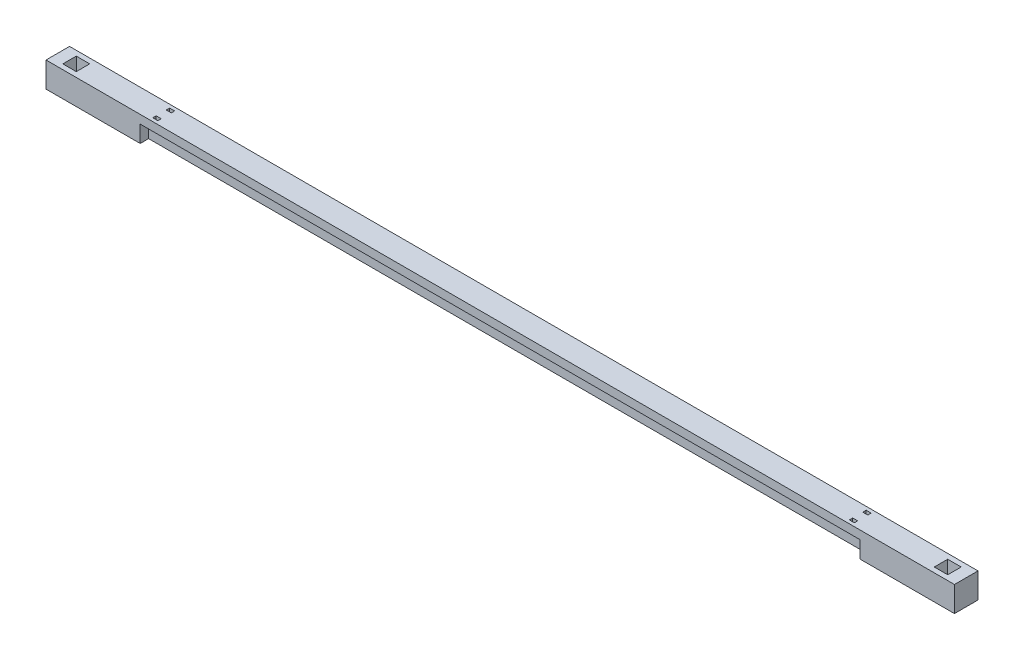
ISO-10303-21;
HEADER;
FILE_DESCRIPTION(('STEP AP214'),'2;1');
FILE_NAME('part.step','',(''),(''),'','','');
FILE_SCHEMA(('AUTOMOTIVE_DESIGN { 1 0 10303 214 1 1 1 1 }'));
ENDSEC;
DATA;
#1=APPLICATION_CONTEXT('core data for automotive mechanical design processes');
#2=APPLICATION_PROTOCOL_DEFINITION('international standard','automotive_design',2000,#1);
#3=PRODUCT_CONTEXT('',#1,'mechanical');
#4=PRODUCT('Part','Part','',(#3));
#5=PRODUCT_RELATED_PRODUCT_CATEGORY('part','',(#4));
#6=PRODUCT_DEFINITION_FORMATION('','',#4);
#7=PRODUCT_DEFINITION_CONTEXT('part definition',#1,'design');
#8=PRODUCT_DEFINITION('design','',#6,#7);
#9=PRODUCT_DEFINITION_SHAPE('','',#8);
#10=(LENGTH_UNIT() NAMED_UNIT(*) SI_UNIT(.MILLI.,.METRE.));
#11=(NAMED_UNIT(*) PLANE_ANGLE_UNIT() SI_UNIT($,.RADIAN.));
#12=(NAMED_UNIT(*) SI_UNIT($,.STERADIAN.) SOLID_ANGLE_UNIT());
#13=UNCERTAINTY_MEASURE_WITH_UNIT(LENGTH_MEASURE(1.E-05),#10,'distance_accuracy_value','');
#14=(GEOMETRIC_REPRESENTATION_CONTEXT(3) GLOBAL_UNCERTAINTY_ASSIGNED_CONTEXT((#13)) GLOBAL_UNIT_ASSIGNED_CONTEXT((#10,
#11,#12)) REPRESENTATION_CONTEXT('',''));
#15=CARTESIAN_POINT('',(0.,0.,0.));
#16=DIRECTION('',(0.,0.,1.));
#17=DIRECTION('',(1.,0.,0.));
#18=AXIS2_PLACEMENT_3D('',#15,#16,#17);
#19=CARTESIAN_POINT('',(0.,150.,0.));
#20=DIRECTION('',(0.,-1.,0.));
#21=DIRECTION('',(0.,0.,-1.));
#22=AXIS2_PLACEMENT_3D('',#19,#20,#21);
#23=PLANE('',#22);
#24=DIRECTION('',(0.,0.,1.));
#25=VECTOR('',#24,1.);
#26=CARTESIAN_POINT('',(0.,150.,50.));
#27=LINE('',#26,#25);
#28=CARTESIAN_POINT('',(0.,150.,-90.));
#29=VERTEX_POINT('',#28);
#30=CARTESIAN_POINT('',(0.,150.,50.));
#31=VERTEX_POINT('',#30);
#32=EDGE_CURVE('E511',#29,#31,#27,.T.);
#33=ORIENTED_EDGE('',*,*,#32,.T.);
#34=DIRECTION('',(1.,0.,0.));
#35=VECTOR('',#34,1.);
#36=CARTESIAN_POINT('',(0.,150.,50.));
#37=LINE('',#36,#35);
#38=CARTESIAN_POINT('',(5400.,150.,50.));
#39=VERTEX_POINT('',#38);
#40=EDGE_CURVE('E514',#31,#39,#37,.T.);
#41=ORIENTED_EDGE('',*,*,#40,.T.);
#42=DIRECTION('',(0.,0.,-1.));
#43=VECTOR('',#42,1.);
#44=CARTESIAN_POINT('',(5400.,150.,50.));
#45=LINE('',#44,#43);
#46=CARTESIAN_POINT('',(5400.,150.,-90.000000000002));
#47=VERTEX_POINT('',#46);
#48=EDGE_CURVE('E517',#39,#47,#45,.T.);
#49=ORIENTED_EDGE('',*,*,#48,.T.);
#50=DIRECTION('',(-1.,0.,0.));
#51=VECTOR('',#50,1.);
#52=CARTESIAN_POINT('',(0.,150.,-90.));
#53=LINE('',#52,#51);
#54=EDGE_CURVE('E519',#47,#29,#53,.T.);
#55=ORIENTED_EDGE('',*,*,#54,.T.);
#56=EDGE_LOOP('',(#33,#41,#49,#55));
#57=FACE_BOUND('',#56,.T.);
#58=DIRECTION('',(0.,0.,1.));
#59=VECTOR('',#58,1.);
#60=CARTESIAN_POINT('',(615.,150.,0.));
#61=LINE('',#60,#59);
#62=CARTESIAN_POINT('',(615.,150.,9.99999999999999));
#63=VERTEX_POINT('',#62);
#64=CARTESIAN_POINT('',(615.,150.,30.));
#65=VERTEX_POINT('',#64);
#66=EDGE_CURVE('E492',#63,#65,#61,.T.);
#67=ORIENTED_EDGE('',*,*,#66,.F.);
#68=DIRECTION('',(1.,0.,0.));
#69=VECTOR('',#68,1.);
#70=CARTESIAN_POINT('',(0.,150.,9.99999999999999));
#71=LINE('',#70,#69);
#72=CARTESIAN_POINT('',(645.,150.,9.99999999999999));
#73=VERTEX_POINT('',#72);
#74=EDGE_CURVE('E482',#63,#73,#71,.T.);
#75=ORIENTED_EDGE('',*,*,#74,.T.);
#76=DIRECTION('',(0.,0.,1.));
#77=VECTOR('',#76,1.);
#78=CARTESIAN_POINT('',(645.,150.,0.));
#79=LINE('',#78,#77);
#80=CARTESIAN_POINT('',(645.,150.,30.));
#81=VERTEX_POINT('',#80);
#82=EDGE_CURVE('E485',#73,#81,#79,.T.);
#83=ORIENTED_EDGE('',*,*,#82,.T.);
#84=DIRECTION('',(1.,0.,0.));
#85=VECTOR('',#84,1.);
#86=CARTESIAN_POINT('',(0.,150.,30.));
#87=LINE('',#86,#85);
#88=EDGE_CURVE('E489',#65,#81,#87,.T.);
#89=ORIENTED_EDGE('',*,*,#88,.F.);
#90=EDGE_LOOP('',(#67,#75,#83,#89));
#91=FACE_BOUND('',#90,.T.);
#92=DIRECTION('',(1.,0.,0.));
#93=VECTOR('',#92,1.);
#94=CARTESIAN_POINT('',(0.,150.,-70.000000000002));
#95=LINE('',#94,#93);
#96=CARTESIAN_POINT('',(615.,150.,-70.000000000002));
#97=VERTEX_POINT('',#96);
#98=CARTESIAN_POINT('',(645.,150.,-70.000000000002));
#99=VERTEX_POINT('',#98);
#100=EDGE_CURVE('E458',#97,#99,#95,.T.);
#101=ORIENTED_EDGE('',*,*,#100,.T.);
#102=DIRECTION('',(0.,0.,1.));
#103=VECTOR('',#102,1.);
#104=CARTESIAN_POINT('',(645.,150.,0.));
#105=LINE('',#104,#103);
#106=CARTESIAN_POINT('',(645.,150.,-50.000000000002));
#107=VERTEX_POINT('',#106);
#108=EDGE_CURVE('E448',#99,#107,#105,.T.);
#109=ORIENTED_EDGE('',*,*,#108,.T.);
#110=DIRECTION('',(-1.,0.,0.));
#111=VECTOR('',#110,1.);
#112=CARTESIAN_POINT('',(0.,150.,-50.0000000000021));
#113=LINE('',#112,#111);
#114=CARTESIAN_POINT('',(615.,150.,-50.000000000002));
#115=VERTEX_POINT('',#114);
#116=EDGE_CURVE('E451',#107,#115,#113,.T.);
#117=ORIENTED_EDGE('',*,*,#116,.T.);
#118=DIRECTION('',(0.,0.,-1.));
#119=VECTOR('',#118,1.);
#120=CARTESIAN_POINT('',(615.,150.,0.));
#121=LINE('',#120,#119);
#122=EDGE_CURVE('E455',#115,#97,#121,.T.);
#123=ORIENTED_EDGE('',*,*,#122,.T.);
#124=EDGE_LOOP('',(#101,#109,#117,#123));
#125=FACE_BOUND('',#124,.T.);
#126=DIRECTION('',(0.,0.,1.));
#127=VECTOR('',#126,1.);
#128=CARTESIAN_POINT('',(4755.,150.,0.));
#129=LINE('',#128,#127);
#130=CARTESIAN_POINT('',(4755.,150.,10.));
#131=VERTEX_POINT('',#130);
#132=CARTESIAN_POINT('',(4755.,150.,30.));
#133=VERTEX_POINT('',#132);
#134=EDGE_CURVE('E429',#131,#133,#129,.T.);
#135=ORIENTED_EDGE('',*,*,#134,.F.);
#136=DIRECTION('',(1.,0.,0.));
#137=VECTOR('',#136,1.);
#138=CARTESIAN_POINT('',(4140.,150.,10.));
#139=LINE('',#138,#137);
#140=CARTESIAN_POINT('',(4785.,150.,10.));
#141=VERTEX_POINT('',#140);
#142=EDGE_CURVE('E419',#131,#141,#139,.T.);
#143=ORIENTED_EDGE('',*,*,#142,.T.);
#144=DIRECTION('',(0.,0.,1.));
#145=VECTOR('',#144,1.);
#146=CARTESIAN_POINT('',(4785.,150.,0.));
#147=LINE('',#146,#145);
#148=CARTESIAN_POINT('',(4785.,150.,30.));
#149=VERTEX_POINT('',#148);
#150=EDGE_CURVE('E422',#141,#149,#147,.T.);
#151=ORIENTED_EDGE('',*,*,#150,.T.);
#152=DIRECTION('',(1.,0.,0.));
#153=VECTOR('',#152,1.);
#154=CARTESIAN_POINT('',(4140.,150.,30.));
#155=LINE('',#154,#153);
#156=EDGE_CURVE('E426',#133,#149,#155,.T.);
#157=ORIENTED_EDGE('',*,*,#156,.F.);
#158=EDGE_LOOP('',(#135,#143,#151,#157));
#159=FACE_BOUND('',#158,.T.);
#160=DIRECTION('',(1.,0.,0.));
#161=VECTOR('',#160,1.);
#162=CARTESIAN_POINT('',(4140.,150.,-70.000000000002));
#163=LINE('',#162,#161);
#164=CARTESIAN_POINT('',(4755.,150.,-70.000000000002));
#165=VERTEX_POINT('',#164);
#166=CARTESIAN_POINT('',(4785.,150.,-70.000000000002));
#167=VERTEX_POINT('',#166);
#168=EDGE_CURVE('E395',#165,#167,#163,.T.);
#169=ORIENTED_EDGE('',*,*,#168,.T.);
#170=DIRECTION('',(0.,0.,1.));
#171=VECTOR('',#170,1.);
#172=CARTESIAN_POINT('',(4785.,150.,0.));
#173=LINE('',#172,#171);
#174=CARTESIAN_POINT('',(4785.,150.,-50.000000000002));
#175=VERTEX_POINT('',#174);
#176=EDGE_CURVE('E385',#167,#175,#173,.T.);
#177=ORIENTED_EDGE('',*,*,#176,.T.);
#178=DIRECTION('',(-1.,0.,0.));
#179=VECTOR('',#178,1.);
#180=CARTESIAN_POINT('',(4140.,150.,-50.0000000000021));
#181=LINE('',#180,#179);
#182=CARTESIAN_POINT('',(4755.,150.,-50.000000000002));
#183=VERTEX_POINT('',#182);
#184=EDGE_CURVE('E388',#175,#183,#181,.T.);
#185=ORIENTED_EDGE('',*,*,#184,.T.);
#186=DIRECTION('',(0.,0.,-1.));
#187=VECTOR('',#186,1.);
#188=CARTESIAN_POINT('',(4755.,150.,0.));
#189=LINE('',#188,#187);
#190=EDGE_CURVE('E392',#183,#165,#189,.T.);
#191=ORIENTED_EDGE('',*,*,#190,.T.);
#192=EDGE_LOOP('',(#169,#177,#185,#191));
#193=FACE_BOUND('',#192,.T.);
#194=DIRECTION('',(-1.,0.,0.));
#195=VECTOR('',#194,1.);
#196=CARTESIAN_POINT('',(5330.,150.,-60.));
#197=LINE('',#196,#195);
#198=CARTESIAN_POINT('',(5330.,150.,-60.));
#199=VERTEX_POINT('',#198);
#200=CARTESIAN_POINT('',(5250.,150.,-60.));
#201=VERTEX_POINT('',#200);
#202=EDGE_CURVE('E322',#199,#201,#197,.T.);
#203=ORIENTED_EDGE('',*,*,#202,.F.);
#204=DIRECTION('',(0.,0.,-1.));
#205=VECTOR('',#204,1.);
#206=CARTESIAN_POINT('',(5330.,150.,-60.));
#207=LINE('',#206,#205);
#208=CARTESIAN_POINT('',(5330.,150.,20.));
#209=VERTEX_POINT('',#208);
#210=EDGE_CURVE('E59',#209,#199,#207,.T.);
#211=ORIENTED_EDGE('',*,*,#210,.F.);
#212=DIRECTION('',(1.,0.,0.));
#213=VECTOR('',#212,1.);
#214=CARTESIAN_POINT('',(5330.,150.,20.));
#215=LINE('',#214,#213);
#216=CARTESIAN_POINT('',(5250.,150.,20.));
#217=VERTEX_POINT('',#216);
#218=EDGE_CURVE('E311',#217,#209,#215,.T.);
#219=ORIENTED_EDGE('',*,*,#218,.F.);
#220=DIRECTION('',(0.,0.,1.));
#221=VECTOR('',#220,1.);
#222=CARTESIAN_POINT('',(5250.,150.,-60.));
#223=LINE('',#222,#221);
#224=EDGE_CURVE('E325',#201,#217,#223,.T.);
#225=ORIENTED_EDGE('',*,*,#224,.F.);
#226=EDGE_LOOP('',(#203,#211,#219,#225));
#227=FACE_BOUND('',#226,.T.);
#228=DIRECTION('',(0.,0.,-1.));
#229=VECTOR('',#228,1.);
#230=CARTESIAN_POINT('',(70.0000000000003,150.,-60.));
#231=LINE('',#230,#229);
#232=CARTESIAN_POINT('',(70.0000000000003,150.,20.));
#233=VERTEX_POINT('',#232);
#234=CARTESIAN_POINT('',(70.0000000000003,150.,-60.));
#235=VERTEX_POINT('',#234);
#236=EDGE_CURVE('E51',#233,#235,#231,.T.);
#237=ORIENTED_EDGE('',*,*,#236,.T.);
#238=DIRECTION('',(1.,0.,0.));
#239=VECTOR('',#238,1.);
#240=CARTESIAN_POINT('',(70.0000000000003,150.,-60.));
#241=LINE('',#240,#239);
#242=CARTESIAN_POINT('',(150.000000000001,150.,-60.));
#243=VERTEX_POINT('',#242);
#244=EDGE_CURVE('E289',#235,#243,#241,.T.);
#245=ORIENTED_EDGE('',*,*,#244,.T.);
#246=DIRECTION('',(0.,0.,1.));
#247=VECTOR('',#246,1.);
#248=CARTESIAN_POINT('',(150.000000000001,150.,-60.));
#249=LINE('',#248,#247);
#250=CARTESIAN_POINT('',(150.,150.,20.));
#251=VERTEX_POINT('',#250);
#252=EDGE_CURVE('E292',#243,#251,#249,.T.);
#253=ORIENTED_EDGE('',*,*,#252,.T.);
#254=DIRECTION('',(-1.,0.,0.));
#255=VECTOR('',#254,1.);
#256=CARTESIAN_POINT('',(70.0000000000003,150.,20.));
#257=LINE('',#256,#255);
#258=EDGE_CURVE('E298',#251,#233,#257,.T.);
#259=ORIENTED_EDGE('',*,*,#258,.T.);
#260=EDGE_LOOP('',(#237,#245,#253,#259));
#261=FACE_BOUND('',#260,.T.);
#262=ADVANCED_FACE('F36',(#57,#91,#125,#159,#193,#227,#261),#23,.F.);
#263=CARTESIAN_POINT('',(0.,100.,0.));
#264=DIRECTION('',(1.,0.,0.));
#265=DIRECTION('',(0.,0.,-1.));
#266=AXIS2_PLACEMENT_3D('',#263,#264,#265);
#267=PLANE('',#266);
#268=DIRECTION('',(0.,0.,1.));
#269=VECTOR('',#268,1.);
#270=CARTESIAN_POINT('',(0.,0.,0.));
#271=LINE('',#270,#269);
#272=CARTESIAN_POINT('',(0.,0.,-90.));
#273=VERTEX_POINT('',#272);
#274=CARTESIAN_POINT('',(0.,0.,50.));
#275=VERTEX_POINT('',#274);
#276=EDGE_CURVE('E536',#273,#275,#271,.T.);
#277=ORIENTED_EDGE('',*,*,#276,.T.);
#278=DIRECTION('',(0.,-1.,0.));
#279=VECTOR('',#278,1.);
#280=CARTESIAN_POINT('',(0.,150.,50.));
#281=LINE('',#280,#279);
#282=EDGE_CURVE('E533',#31,#275,#281,.T.);
#283=ORIENTED_EDGE('',*,*,#282,.F.);
#284=ORIENTED_EDGE('',*,*,#32,.F.);
#285=DIRECTION('',(0.,-1.,0.));
#286=VECTOR('',#285,1.);
#287=CARTESIAN_POINT('',(0.,150.,-90.));
#288=LINE('',#287,#286);
#289=EDGE_CURVE('E521',#29,#273,#288,.T.);
#290=ORIENTED_EDGE('',*,*,#289,.T.);
#291=EDGE_LOOP('',(#277,#283,#284,#290));
#292=FACE_BOUND('',#291,.T.);
#293=ADVANCED_FACE('F38',(#292),#267,.F.);
#294=CARTESIAN_POINT('',(0.,100.,0.));
#295=DIRECTION('',(0.,0.,-1.));
#296=DIRECTION('',(-1.,0.,0.));
#297=AXIS2_PLACEMENT_3D('',#294,#295,#296);
#298=PLANE('',#297);
#299=DIRECTION('',(1.,0.,0.));
#300=VECTOR('',#299,1.);
#301=CARTESIAN_POINT('',(0.,100.,0.));
#302=LINE('',#301,#300);
#303=CARTESIAN_POINT('',(560.,100.,0.));
#304=VERTEX_POINT('',#303);
#305=CARTESIAN_POINT('',(4840.,100.,0.));
#306=VERTEX_POINT('',#305);
#307=EDGE_CURVE('E537',#304,#306,#302,.T.);
#308=ORIENTED_EDGE('',*,*,#307,.F.);
#309=DIRECTION('',(0.,-1.,0.));
#310=VECTOR('',#309,1.);
#311=CARTESIAN_POINT('',(560.,100.,0.));
#312=LINE('',#311,#310);
#313=CARTESIAN_POINT('',(560.,0.,0.));
#314=VERTEX_POINT('',#313);
#315=EDGE_CURVE('E358',#304,#314,#312,.T.);
#316=ORIENTED_EDGE('',*,*,#315,.T.);
#317=DIRECTION('',(1.,0.,0.));
#318=VECTOR('',#317,1.);
#319=CARTESIAN_POINT('',(0.,0.,0.));
#320=LINE('',#319,#318);
#321=CARTESIAN_POINT('',(4840.,0.,0.));
#322=VERTEX_POINT('',#321);
#323=EDGE_CURVE('E543',#314,#322,#320,.T.);
#324=ORIENTED_EDGE('',*,*,#323,.T.);
#325=DIRECTION('',(0.,1.,0.));
#326=VECTOR('',#325,1.);
#327=CARTESIAN_POINT('',(4840.,100.,0.));
#328=LINE('',#327,#326);
#329=EDGE_CURVE('E381',#322,#306,#328,.T.);
#330=ORIENTED_EDGE('',*,*,#329,.T.);
#331=EDGE_LOOP('',(#308,#316,#324,#330));
#332=FACE_BOUND('',#331,.T.);
#333=ADVANCED_FACE('F581',(#332),#298,.F.);
#334=CARTESIAN_POINT('',(5400.,100.,0.));
#335=DIRECTION('',(-1.,0.,0.));
#336=DIRECTION('',(0.,0.,1.));
#337=AXIS2_PLACEMENT_3D('',#334,#335,#336);
#338=PLANE('',#337);
#339=DIRECTION('',(0.,-1.,0.));
#340=VECTOR('',#339,1.);
#341=CARTESIAN_POINT('',(5400.,150.,50.));
#342=LINE('',#341,#340);
#343=CARTESIAN_POINT('',(5400.,0.,49.999999999998));
#344=VERTEX_POINT('',#343);
#345=EDGE_CURVE('E530',#39,#344,#342,.T.);
#346=ORIENTED_EDGE('',*,*,#345,.T.);
#347=DIRECTION('',(0.,0.,-1.));
#348=VECTOR('',#347,1.);
#349=CARTESIAN_POINT('',(5400.,0.,0.));
#350=LINE('',#349,#348);
#351=CARTESIAN_POINT('',(5400.,0.,-90.000000000002));
#352=VERTEX_POINT('',#351);
#353=EDGE_CURVE('E545',#344,#352,#350,.T.);
#354=ORIENTED_EDGE('',*,*,#353,.T.);
#355=DIRECTION('',(0.,-1.,0.));
#356=VECTOR('',#355,1.);
#357=CARTESIAN_POINT('',(5400.,150.,-90.000000000002));
#358=LINE('',#357,#356);
#359=EDGE_CURVE('E527',#47,#352,#358,.T.);
#360=ORIENTED_EDGE('',*,*,#359,.F.);
#361=ORIENTED_EDGE('',*,*,#48,.F.);
#362=EDGE_LOOP('',(#346,#354,#360,#361));
#363=FACE_BOUND('',#362,.T.);
#364=ADVANCED_FACE('F569',(#363),#338,.F.);
#365=CARTESIAN_POINT('',(0.,100.,-40.));
#366=DIRECTION('',(0.,0.,1.));
#367=DIRECTION('',(1.,0.,0.));
#368=AXIS2_PLACEMENT_3D('',#365,#366,#367);
#369=PLANE('',#368);
#370=DIRECTION('',(-1.,0.,0.));
#371=VECTOR('',#370,1.);
#372=CARTESIAN_POINT('',(0.,0.,-40.));
#373=LINE('',#372,#371);
#374=CARTESIAN_POINT('',(4840.,0.,-40.));
#375=VERTEX_POINT('',#374);
#376=CARTESIAN_POINT('',(560.,0.,-40.));
#377=VERTEX_POINT('',#376);
#378=EDGE_CURVE('E539',#375,#377,#373,.T.);
#379=ORIENTED_EDGE('',*,*,#378,.T.);
#380=DIRECTION('',(0.,1.,0.));
#381=VECTOR('',#380,1.);
#382=CARTESIAN_POINT('',(560.,100.,-40.));
#383=LINE('',#382,#381);
#384=CARTESIAN_POINT('',(560.,100.,-40.));
#385=VERTEX_POINT('',#384);
#386=EDGE_CURVE('E353',#377,#385,#383,.T.);
#387=ORIENTED_EDGE('',*,*,#386,.T.);
#388=DIRECTION('',(-1.,0.,0.));
#389=VECTOR('',#388,1.);
#390=CARTESIAN_POINT('',(0.,100.,-40.));
#391=LINE('',#390,#389);
#392=CARTESIAN_POINT('',(4840.,100.,-40.));
#393=VERTEX_POINT('',#392);
#394=EDGE_CURVE('E44',#393,#385,#391,.T.);
#395=ORIENTED_EDGE('',*,*,#394,.F.);
#396=DIRECTION('',(0.,-1.,0.));
#397=VECTOR('',#396,1.);
#398=CARTESIAN_POINT('',(4840.,100.,-40.));
#399=LINE('',#398,#397);
#400=EDGE_CURVE('E378',#393,#375,#399,.T.);
#401=ORIENTED_EDGE('',*,*,#400,.T.);
#402=EDGE_LOOP('',(#379,#387,#395,#401));
#403=FACE_BOUND('',#402,.T.);
#404=ADVANCED_FACE('F549',(#403),#369,.F.);
#405=CARTESIAN_POINT('',(0.,0.,0.));
#406=DIRECTION('',(0.,-1.,0.));
#407=DIRECTION('',(0.,0.,-1.));
#408=AXIS2_PLACEMENT_3D('',#405,#406,#407);
#409=PLANE('',#408);
#410=ORIENTED_EDGE('',*,*,#323,.F.);
#411=DIRECTION('',(0.,0.,1.));
#412=VECTOR('',#411,1.);
#413=CARTESIAN_POINT('',(560.,0.,-89.9999999999999));
#414=LINE('',#413,#412);
#415=CARTESIAN_POINT('',(560.,0.,50.0000000000001));
#416=VERTEX_POINT('',#415);
#417=EDGE_CURVE('E332',#314,#416,#414,.T.);
#418=ORIENTED_EDGE('',*,*,#417,.T.);
#419=DIRECTION('',(-1.,0.,0.));
#420=VECTOR('',#419,1.);
#421=CARTESIAN_POINT('',(560.,0.,50.0000000000001));
#422=LINE('',#421,#420);
#423=EDGE_CURVE('E345',#416,#275,#422,.T.);
#424=ORIENTED_EDGE('',*,*,#423,.T.);
#425=ORIENTED_EDGE('',*,*,#276,.F.);
#426=DIRECTION('',(1.,0.,0.));
#427=VECTOR('',#426,1.);
#428=CARTESIAN_POINT('',(560.,0.,-89.9999999999999));
#429=LINE('',#428,#427);
#430=CARTESIAN_POINT('',(560.,0.,-89.9999999999999));
#431=VERTEX_POINT('',#430);
#432=EDGE_CURVE('E348',#273,#431,#429,.T.);
#433=ORIENTED_EDGE('',*,*,#432,.T.);
#434=EDGE_CURVE('E342',#431,#377,#414,.T.);
#435=ORIENTED_EDGE('',*,*,#434,.T.);
#436=ORIENTED_EDGE('',*,*,#378,.F.);
#437=DIRECTION('',(0.,0.,-1.));
#438=VECTOR('',#437,1.);
#439=CARTESIAN_POINT('',(4840.,0.,-90.0000000000021));
#440=LINE('',#439,#438);
#441=CARTESIAN_POINT('',(4840.,0.,-90.0000000000021));
#442=VERTEX_POINT('',#441);
#443=EDGE_CURVE('E369',#375,#442,#440,.T.);
#444=ORIENTED_EDGE('',*,*,#443,.T.);
#445=DIRECTION('',(1.,0.,0.));
#446=VECTOR('',#445,1.);
#447=CARTESIAN_POINT('',(5400.,0.,-90.000000000002));
#448=LINE('',#447,#446);
#449=EDGE_CURVE('E366',#442,#352,#448,.T.);
#450=ORIENTED_EDGE('',*,*,#449,.T.);
#451=ORIENTED_EDGE('',*,*,#353,.F.);
#452=DIRECTION('',(-1.,0.,0.));
#453=VECTOR('',#452,1.);
#454=CARTESIAN_POINT('',(5400.,0.,49.999999999998));
#455=LINE('',#454,#453);
#456=CARTESIAN_POINT('',(4840.,0.,49.9999999999979));
#457=VERTEX_POINT('',#456);
#458=EDGE_CURVE('E361',#344,#457,#455,.T.);
#459=ORIENTED_EDGE('',*,*,#458,.T.);
#460=EDGE_CURVE('E370',#457,#322,#440,.T.);
#461=ORIENTED_EDGE('',*,*,#460,.T.);
#462=EDGE_LOOP('',(#410,#418,#424,#425,#433,#435,#436,#444,#450,#451,#459,#461));
#463=FACE_BOUND('',#462,.T.);
#464=ADVANCED_FACE('F555',(#463),#409,.T.);
#465=CARTESIAN_POINT('',(0.,100.,0.));
#466=DIRECTION('',(0.,-1.,0.));
#467=DIRECTION('',(0.,0.,-1.));
#468=AXIS2_PLACEMENT_3D('',#465,#466,#467);
#469=PLANE('',#468);
#470=DIRECTION('',(0.,0.,1.));
#471=VECTOR('',#470,1.);
#472=CARTESIAN_POINT('',(560.,100.,-89.9999999999999));
#473=LINE('',#472,#471);
#474=CARTESIAN_POINT('',(560.,100.,50.));
#475=VERTEX_POINT('',#474);
#476=EDGE_CURVE('E341',#304,#475,#473,.T.);
#477=ORIENTED_EDGE('',*,*,#476,.F.);
#478=ORIENTED_EDGE('',*,*,#307,.T.);
#479=DIRECTION('',(0.,0.,-1.));
#480=VECTOR('',#479,1.);
#481=CARTESIAN_POINT('',(4840.,100.,-90.0000000000021));
#482=LINE('',#481,#480);
#483=CARTESIAN_POINT('',(4840.,100.,49.9999999999979));
#484=VERTEX_POINT('',#483);
#485=EDGE_CURVE('E362',#484,#306,#482,.T.);
#486=ORIENTED_EDGE('',*,*,#485,.F.);
#487=DIRECTION('',(1.,0.,0.));
#488=VECTOR('',#487,1.);
#489=CARTESIAN_POINT('',(0.,100.,50.));
#490=LINE('',#489,#488);
#491=EDGE_CURVE('E475',#475,#484,#490,.T.);
#492=ORIENTED_EDGE('',*,*,#491,.F.);
#493=EDGE_LOOP('',(#477,#478,#486,#492));
#494=FACE_BOUND('',#493,.T.);
#495=DIRECTION('',(1.,0.,0.));
#496=VECTOR('',#495,1.);
#497=CARTESIAN_POINT('',(4140.,100.,10.));
#498=LINE('',#497,#496);
#499=CARTESIAN_POINT('',(4755.,100.,10.));
#500=VERTEX_POINT('',#499);
#501=CARTESIAN_POINT('',(4785.,100.,10.));
#502=VERTEX_POINT('',#501);
#503=EDGE_CURVE('E384',#500,#502,#498,.T.);
#504=ORIENTED_EDGE('',*,*,#503,.F.);
#505=DIRECTION('',(0.,0.,1.));
#506=VECTOR('',#505,1.);
#507=CARTESIAN_POINT('',(4755.,100.,0.));
#508=LINE('',#507,#506);
#509=CARTESIAN_POINT('',(4755.,100.,30.));
#510=VERTEX_POINT('',#509);
#511=EDGE_CURVE('E423',#500,#510,#508,.T.);
#512=ORIENTED_EDGE('',*,*,#511,.T.);
#513=DIRECTION('',(1.,0.,0.));
#514=VECTOR('',#513,1.);
#515=CARTESIAN_POINT('',(4140.,100.,30.));
#516=LINE('',#515,#514);
#517=CARTESIAN_POINT('',(4785.,100.,30.));
#518=VERTEX_POINT('',#517);
#519=EDGE_CURVE('E436',#510,#518,#516,.T.);
#520=ORIENTED_EDGE('',*,*,#519,.T.);
#521=DIRECTION('',(0.,0.,1.));
#522=VECTOR('',#521,1.);
#523=CARTESIAN_POINT('',(4785.,100.,0.));
#524=LINE('',#523,#522);
#525=EDGE_CURVE('E433',#502,#518,#524,.T.);
#526=ORIENTED_EDGE('',*,*,#525,.F.);
#527=EDGE_LOOP('',(#504,#512,#520,#526));
#528=FACE_BOUND('',#527,.T.);
#529=DIRECTION('',(1.,0.,0.));
#530=VECTOR('',#529,1.);
#531=CARTESIAN_POINT('',(0.,100.,9.99999999999999));
#532=LINE('',#531,#530);
#533=CARTESIAN_POINT('',(615.,100.,9.99999999999999));
#534=VERTEX_POINT('',#533);
#535=CARTESIAN_POINT('',(645.,100.,9.99999999999999));
#536=VERTEX_POINT('',#535);
#537=EDGE_CURVE('E412',#534,#536,#532,.T.);
#538=ORIENTED_EDGE('',*,*,#537,.F.);
#539=DIRECTION('',(0.,0.,1.));
#540=VECTOR('',#539,1.);
#541=CARTESIAN_POINT('',(615.,100.,0.));
#542=LINE('',#541,#540);
#543=CARTESIAN_POINT('',(615.,100.,30.));
#544=VERTEX_POINT('',#543);
#545=EDGE_CURVE('E486',#534,#544,#542,.T.);
#546=ORIENTED_EDGE('',*,*,#545,.T.);
#547=DIRECTION('',(1.,0.,0.));
#548=VECTOR('',#547,1.);
#549=CARTESIAN_POINT('',(0.,100.,30.));
#550=LINE('',#549,#548);
#551=CARTESIAN_POINT('',(645.,100.,30.));
#552=VERTEX_POINT('',#551);
#553=EDGE_CURVE('E499',#544,#552,#550,.T.);
#554=ORIENTED_EDGE('',*,*,#553,.T.);
#555=DIRECTION('',(0.,0.,1.));
#556=VECTOR('',#555,1.);
#557=CARTESIAN_POINT('',(645.,100.,0.));
#558=LINE('',#557,#556);
#559=EDGE_CURVE('E496',#536,#552,#558,.T.);
#560=ORIENTED_EDGE('',*,*,#559,.F.);
#561=EDGE_LOOP('',(#538,#546,#554,#560));
#562=FACE_BOUND('',#561,.T.);
#563=ADVANCED_FACE('F587',(#494,#528,#562),#469,.T.);
#564=CARTESIAN_POINT('',(0.,150.,50.));
#565=DIRECTION('',(0.,0.,-1.));
#566=DIRECTION('',(-1.,0.,0.));
#567=AXIS2_PLACEMENT_3D('',#564,#565,#566);
#568=PLANE('',#567);
#569=ORIENTED_EDGE('',*,*,#282,.T.);
#570=ORIENTED_EDGE('',*,*,#423,.F.);
#571=DIRECTION('',(0.,-1.,0.));
#572=VECTOR('',#571,1.);
#573=CARTESIAN_POINT('',(560.,100.,50.0000000000001));
#574=LINE('',#573,#572);
#575=EDGE_CURVE('E340',#475,#416,#574,.T.);
#576=ORIENTED_EDGE('',*,*,#575,.F.);
#577=ORIENTED_EDGE('',*,*,#491,.T.);
#578=DIRECTION('',(0.,-1.,0.));
#579=VECTOR('',#578,1.);
#580=CARTESIAN_POINT('',(4840.,100.,49.9999999999979));
#581=LINE('',#580,#579);
#582=EDGE_CURVE('E365',#484,#457,#581,.T.);
#583=ORIENTED_EDGE('',*,*,#582,.T.);
#584=ORIENTED_EDGE('',*,*,#458,.F.);
#585=ORIENTED_EDGE('',*,*,#345,.F.);
#586=ORIENTED_EDGE('',*,*,#40,.F.);
#587=EDGE_LOOP('',(#569,#570,#576,#577,#583,#584,#585,#586));
#588=FACE_BOUND('',#587,.T.);
#589=ADVANCED_FACE('F571',(#588),#568,.F.);
#590=CARTESIAN_POINT('',(0.,150.,-90.));
#591=DIRECTION('',(0.,0.,1.));
#592=DIRECTION('',(1.,0.,0.));
#593=AXIS2_PLACEMENT_3D('',#590,#591,#592);
#594=PLANE('',#593);
#595=ORIENTED_EDGE('',*,*,#359,.T.);
#596=ORIENTED_EDGE('',*,*,#449,.F.);
#597=DIRECTION('',(0.,-1.,0.));
#598=VECTOR('',#597,1.);
#599=CARTESIAN_POINT('',(4840.,100.,-90.0000000000021));
#600=LINE('',#599,#598);
#601=CARTESIAN_POINT('',(4840.,100.,-90.0000000000021));
#602=VERTEX_POINT('',#601);
#603=EDGE_CURVE('E375',#602,#442,#600,.T.);
#604=ORIENTED_EDGE('',*,*,#603,.F.);
#605=DIRECTION('',(-1.,0.,0.));
#606=VECTOR('',#605,1.);
#607=CARTESIAN_POINT('',(0.,100.,-90.));
#608=LINE('',#607,#606);
#609=CARTESIAN_POINT('',(560.,100.,-89.9999999999999));
#610=VERTEX_POINT('',#609);
#611=EDGE_CURVE('E515',#602,#610,#608,.T.);
#612=ORIENTED_EDGE('',*,*,#611,.T.);
#613=DIRECTION('',(0.,-1.,0.));
#614=VECTOR('',#613,1.);
#615=CARTESIAN_POINT('',(560.,100.,-89.9999999999999));
#616=LINE('',#615,#614);
#617=EDGE_CURVE('E351',#610,#431,#616,.T.);
#618=ORIENTED_EDGE('',*,*,#617,.T.);
#619=ORIENTED_EDGE('',*,*,#432,.F.);
#620=ORIENTED_EDGE('',*,*,#289,.F.);
#621=ORIENTED_EDGE('',*,*,#54,.F.);
#622=EDGE_LOOP('',(#595,#596,#604,#612,#618,#619,#620,#621));
#623=FACE_BOUND('',#622,.T.);
#624=ADVANCED_FACE('F562',(#623),#594,.F.);
#625=EDGE_CURVE('E338',#610,#385,#473,.T.);
#626=ORIENTED_EDGE('',*,*,#625,.F.);
#627=ORIENTED_EDGE('',*,*,#611,.F.);
#628=DIRECTION('',(0.,0.,-1.));
#629=VECTOR('',#628,1.);
#630=CARTESIAN_POINT('',(4840.,100.,0.));
#631=LINE('',#630,#629);
#632=EDGE_CURVE('E11',#393,#602,#631,.T.);
#633=ORIENTED_EDGE('',*,*,#632,.F.);
#634=ORIENTED_EDGE('',*,*,#394,.T.);
#635=EDGE_LOOP('',(#626,#627,#633,#634));
#636=FACE_BOUND('',#635,.T.);
#637=DIRECTION('',(0.,0.,1.));
#638=VECTOR('',#637,1.);
#639=CARTESIAN_POINT('',(4785.,100.,0.));
#640=LINE('',#639,#638);
#641=CARTESIAN_POINT('',(4785.,100.,-70.000000000002));
#642=VERTEX_POINT('',#641);
#643=CARTESIAN_POINT('',(4785.,100.,-50.000000000002));
#644=VERTEX_POINT('',#643);
#645=EDGE_CURVE('E399',#642,#644,#640,.T.);
#646=ORIENTED_EDGE('',*,*,#645,.F.);
#647=DIRECTION('',(1.,0.,0.));
#648=VECTOR('',#647,1.);
#649=CARTESIAN_POINT('',(4140.,100.,-70.000000000002));
#650=LINE('',#649,#648);
#651=CARTESIAN_POINT('',(4755.,100.,-70.000000000002));
#652=VERTEX_POINT('',#651);
#653=EDGE_CURVE('E389',#652,#642,#650,.T.);
#654=ORIENTED_EDGE('',*,*,#653,.F.);
#655=DIRECTION('',(0.,0.,-1.));
#656=VECTOR('',#655,1.);
#657=CARTESIAN_POINT('',(4755.,100.,0.));
#658=LINE('',#657,#656);
#659=CARTESIAN_POINT('',(4755.,100.,-50.000000000002));
#660=VERTEX_POINT('',#659);
#661=EDGE_CURVE('E405',#660,#652,#658,.T.);
#662=ORIENTED_EDGE('',*,*,#661,.F.);
#663=DIRECTION('',(-1.,0.,0.));
#664=VECTOR('',#663,1.);
#665=CARTESIAN_POINT('',(4140.,100.,-50.0000000000021));
#666=LINE('',#665,#664);
#667=EDGE_CURVE('E401',#644,#660,#666,.T.);
#668=ORIENTED_EDGE('',*,*,#667,.F.);
#669=EDGE_LOOP('',(#646,#654,#662,#668));
#670=FACE_BOUND('',#669,.T.);
#671=DIRECTION('',(0.,0.,1.));
#672=VECTOR('',#671,1.);
#673=CARTESIAN_POINT('',(645.,100.,0.));
#674=LINE('',#673,#672);
#675=CARTESIAN_POINT('',(645.,100.,-70.000000000002));
#676=VERTEX_POINT('',#675);
#677=CARTESIAN_POINT('',(645.,100.,-50.000000000002));
#678=VERTEX_POINT('',#677);
#679=EDGE_CURVE('E462',#676,#678,#674,.T.);
#680=ORIENTED_EDGE('',*,*,#679,.F.);
#681=DIRECTION('',(1.,0.,0.));
#682=VECTOR('',#681,1.);
#683=CARTESIAN_POINT('',(0.,100.,-70.000000000002));
#684=LINE('',#683,#682);
#685=CARTESIAN_POINT('',(615.,100.,-70.000000000002));
#686=VERTEX_POINT('',#685);
#687=EDGE_CURVE('E452',#686,#676,#684,.T.);
#688=ORIENTED_EDGE('',*,*,#687,.F.);
#689=DIRECTION('',(0.,0.,-1.));
#690=VECTOR('',#689,1.);
#691=CARTESIAN_POINT('',(615.,100.,0.));
#692=LINE('',#691,#690);
#693=CARTESIAN_POINT('',(615.,100.,-50.000000000002));
#694=VERTEX_POINT('',#693);
#695=EDGE_CURVE('E468',#694,#686,#692,.T.);
#696=ORIENTED_EDGE('',*,*,#695,.F.);
#697=DIRECTION('',(-1.,0.,0.));
#698=VECTOR('',#697,1.);
#699=CARTESIAN_POINT('',(0.,100.,-50.0000000000021));
#700=LINE('',#699,#698);
#701=EDGE_CURVE('E464',#678,#694,#700,.T.);
#702=ORIENTED_EDGE('',*,*,#701,.F.);
#703=EDGE_LOOP('',(#680,#688,#696,#702));
#704=FACE_BOUND('',#703,.T.);
#705=ADVANCED_FACE('F591',(#636,#670,#704),#469,.T.);
#706=CARTESIAN_POINT('',(645.,150.,0.));
#707=DIRECTION('',(1.,0.,0.));
#708=DIRECTION('',(0.,0.,-1.));
#709=AXIS2_PLACEMENT_3D('',#706,#707,#708);
#710=PLANE('',#709);
#711=ORIENTED_EDGE('',*,*,#679,.T.);
#712=DIRECTION('',(0.,-1.,0.));
#713=VECTOR('',#712,1.);
#714=CARTESIAN_POINT('',(645.,150.,-50.000000000002));
#715=LINE('',#714,#713);
#716=EDGE_CURVE('E461',#107,#678,#715,.T.);
#717=ORIENTED_EDGE('',*,*,#716,.F.);
#718=ORIENTED_EDGE('',*,*,#108,.F.);
#719=DIRECTION('',(0.,-1.,0.));
#720=VECTOR('',#719,1.);
#721=CARTESIAN_POINT('',(645.,150.,-70.000000000002));
#722=LINE('',#721,#720);
#723=EDGE_CURVE('E473',#99,#676,#722,.T.);
#724=ORIENTED_EDGE('',*,*,#723,.T.);
#725=EDGE_LOOP('',(#711,#717,#718,#724));
#726=FACE_BOUND('',#725,.T.);
#727=ADVANCED_FACE('F633',(#726),#710,.F.);
#728=CARTESIAN_POINT('',(0.,150.,-70.000000000002));
#729=DIRECTION('',(0.,0.,-1.));
#730=DIRECTION('',(-1.,0.,0.));
#731=AXIS2_PLACEMENT_3D('',#728,#729,#730);
#732=PLANE('',#731);
#733=ORIENTED_EDGE('',*,*,#687,.T.);
#734=ORIENTED_EDGE('',*,*,#723,.F.);
#735=ORIENTED_EDGE('',*,*,#100,.F.);
#736=DIRECTION('',(0.,-1.,0.));
#737=VECTOR('',#736,1.);
#738=CARTESIAN_POINT('',(615.,150.,-70.000000000002));
#739=LINE('',#738,#737);
#740=EDGE_CURVE('E476',#97,#686,#739,.T.);
#741=ORIENTED_EDGE('',*,*,#740,.T.);
#742=EDGE_LOOP('',(#733,#734,#735,#741));
#743=FACE_BOUND('',#742,.T.);
#744=ADVANCED_FACE('F686',(#743),#732,.F.);
#745=CARTESIAN_POINT('',(615.,150.,0.));
#746=DIRECTION('',(-1.,0.,0.));
#747=DIRECTION('',(0.,0.,1.));
#748=AXIS2_PLACEMENT_3D('',#745,#746,#747);
#749=PLANE('',#748);
#750=ORIENTED_EDGE('',*,*,#695,.T.);
#751=ORIENTED_EDGE('',*,*,#740,.F.);
#752=ORIENTED_EDGE('',*,*,#122,.F.);
#753=DIRECTION('',(0.,-1.,0.));
#754=VECTOR('',#753,1.);
#755=CARTESIAN_POINT('',(615.,150.,-50.000000000002));
#756=LINE('',#755,#754);
#757=EDGE_CURVE('E478',#115,#694,#756,.T.);
#758=ORIENTED_EDGE('',*,*,#757,.T.);
#759=EDGE_LOOP('',(#750,#751,#752,#758));
#760=FACE_BOUND('',#759,.T.);
#761=ADVANCED_FACE('F694',(#760),#749,.F.);
#762=CARTESIAN_POINT('',(0.,150.,-50.0000000000021));
#763=DIRECTION('',(0.,0.,1.));
#764=DIRECTION('',(1.,0.,0.));
#765=AXIS2_PLACEMENT_3D('',#762,#763,#764);
#766=PLANE('',#765);
#767=ORIENTED_EDGE('',*,*,#701,.T.);
#768=ORIENTED_EDGE('',*,*,#757,.F.);
#769=ORIENTED_EDGE('',*,*,#116,.F.);
#770=ORIENTED_EDGE('',*,*,#716,.T.);
#771=EDGE_LOOP('',(#767,#768,#769,#770));
#772=FACE_BOUND('',#771,.T.);
#773=ADVANCED_FACE('F702',(#772),#766,.F.);
#774=CARTESIAN_POINT('',(0.,150.,9.99999999999999));
#775=DIRECTION('',(0.,0.,-1.));
#776=DIRECTION('',(-1.,0.,0.));
#777=AXIS2_PLACEMENT_3D('',#774,#775,#776);
#778=PLANE('',#777);
#779=ORIENTED_EDGE('',*,*,#537,.T.);
#780=DIRECTION('',(0.,-1.,0.));
#781=VECTOR('',#780,1.);
#782=CARTESIAN_POINT('',(645.,150.,9.99999999999999));
#783=LINE('',#782,#781);
#784=EDGE_CURVE('E494',#73,#536,#783,.T.);
#785=ORIENTED_EDGE('',*,*,#784,.F.);
#786=ORIENTED_EDGE('',*,*,#74,.F.);
#787=DIRECTION('',(0.,-1.,0.));
#788=VECTOR('',#787,1.);
#789=CARTESIAN_POINT('',(615.,150.,9.99999999999999));
#790=LINE('',#789,#788);
#791=EDGE_CURVE('E465',#63,#534,#790,.T.);
#792=ORIENTED_EDGE('',*,*,#791,.T.);
#793=EDGE_LOOP('',(#779,#785,#786,#792));
#794=FACE_BOUND('',#793,.T.);
#795=ADVANCED_FACE('F599',(#794),#778,.F.);
#796=CARTESIAN_POINT('',(615.,150.,0.));
#797=DIRECTION('',(1.,0.,0.));
#798=DIRECTION('',(0.,0.,-1.));
#799=AXIS2_PLACEMENT_3D('',#796,#797,#798);
#800=PLANE('',#799);
#801=ORIENTED_EDGE('',*,*,#545,.F.);
#802=ORIENTED_EDGE('',*,*,#791,.F.);
#803=ORIENTED_EDGE('',*,*,#66,.T.);
#804=DIRECTION('',(0.,-1.,0.));
#805=VECTOR('',#804,1.);
#806=CARTESIAN_POINT('',(615.,150.,30.));
#807=LINE('',#806,#805);
#808=EDGE_CURVE('E505',#65,#544,#807,.T.);
#809=ORIENTED_EDGE('',*,*,#808,.T.);
#810=EDGE_LOOP('',(#801,#802,#803,#809));
#811=FACE_BOUND('',#810,.T.);
#812=ADVANCED_FACE('F610',(#811),#800,.T.);
#813=CARTESIAN_POINT('',(0.,150.,30.));
#814=DIRECTION('',(0.,0.,-1.));
#815=DIRECTION('',(-1.,0.,0.));
#816=AXIS2_PLACEMENT_3D('',#813,#814,#815);
#817=PLANE('',#816);
#818=ORIENTED_EDGE('',*,*,#553,.F.);
#819=ORIENTED_EDGE('',*,*,#808,.F.);
#820=ORIENTED_EDGE('',*,*,#88,.T.);
#821=DIRECTION('',(0.,-1.,0.));
#822=VECTOR('',#821,1.);
#823=CARTESIAN_POINT('',(645.,150.,30.));
#824=LINE('',#823,#822);
#825=EDGE_CURVE('E507',#81,#552,#824,.T.);
#826=ORIENTED_EDGE('',*,*,#825,.T.);
#827=EDGE_LOOP('',(#818,#819,#820,#826));
#828=FACE_BOUND('',#827,.T.);
#829=ADVANCED_FACE('F613',(#828),#817,.T.);
#830=CARTESIAN_POINT('',(645.,150.,0.));
#831=DIRECTION('',(1.,0.,0.));
#832=DIRECTION('',(0.,0.,-1.));
#833=AXIS2_PLACEMENT_3D('',#830,#831,#832);
#834=PLANE('',#833);
#835=ORIENTED_EDGE('',*,*,#559,.T.);
#836=ORIENTED_EDGE('',*,*,#825,.F.);
#837=ORIENTED_EDGE('',*,*,#82,.F.);
#838=ORIENTED_EDGE('',*,*,#784,.T.);
#839=EDGE_LOOP('',(#835,#836,#837,#838));
#840=FACE_BOUND('',#839,.T.);
#841=ADVANCED_FACE('F603',(#840),#834,.F.);
#842=CARTESIAN_POINT('',(4785.,150.,0.));
#843=DIRECTION('',(1.,0.,0.));
#844=DIRECTION('',(0.,0.,-1.));
#845=AXIS2_PLACEMENT_3D('',#842,#843,#844);
#846=PLANE('',#845);
#847=ORIENTED_EDGE('',*,*,#645,.T.);
#848=DIRECTION('',(0.,-1.,0.));
#849=VECTOR('',#848,1.);
#850=CARTESIAN_POINT('',(4785.,150.,-50.000000000002));
#851=LINE('',#850,#849);
#852=EDGE_CURVE('E398',#175,#644,#851,.T.);
#853=ORIENTED_EDGE('',*,*,#852,.F.);
#854=ORIENTED_EDGE('',*,*,#176,.F.);
#855=DIRECTION('',(0.,-1.,0.));
#856=VECTOR('',#855,1.);
#857=CARTESIAN_POINT('',(4785.,150.,-70.000000000002));
#858=LINE('',#857,#856);
#859=EDGE_CURVE('E410',#167,#642,#858,.T.);
#860=ORIENTED_EDGE('',*,*,#859,.T.);
#861=EDGE_LOOP('',(#847,#853,#854,#860));
#862=FACE_BOUND('',#861,.T.);
#863=ADVANCED_FACE('F620',(#862),#846,.F.);
#864=CARTESIAN_POINT('',(4140.,150.,-70.000000000002));
#865=DIRECTION('',(0.,0.,-1.));
#866=DIRECTION('',(-1.,0.,0.));
#867=AXIS2_PLACEMENT_3D('',#864,#865,#866);
#868=PLANE('',#867);
#869=ORIENTED_EDGE('',*,*,#653,.T.);
#870=ORIENTED_EDGE('',*,*,#859,.F.);
#871=ORIENTED_EDGE('',*,*,#168,.F.);
#872=DIRECTION('',(0.,-1.,0.));
#873=VECTOR('',#872,1.);
#874=CARTESIAN_POINT('',(4755.,150.,-70.000000000002));
#875=LINE('',#874,#873);
#876=EDGE_CURVE('E413',#165,#652,#875,.T.);
#877=ORIENTED_EDGE('',*,*,#876,.T.);
#878=EDGE_LOOP('',(#869,#870,#871,#877));
#879=FACE_BOUND('',#878,.T.);
#880=ADVANCED_FACE('F739',(#879),#868,.F.);
#881=CARTESIAN_POINT('',(4755.,150.,0.));
#882=DIRECTION('',(-1.,0.,0.));
#883=DIRECTION('',(0.,0.,1.));
#884=AXIS2_PLACEMENT_3D('',#881,#882,#883);
#885=PLANE('',#884);
#886=ORIENTED_EDGE('',*,*,#661,.T.);
#887=ORIENTED_EDGE('',*,*,#876,.F.);
#888=ORIENTED_EDGE('',*,*,#190,.F.);
#889=DIRECTION('',(0.,-1.,0.));
#890=VECTOR('',#889,1.);
#891=CARTESIAN_POINT('',(4755.,150.,-50.000000000002));
#892=LINE('',#891,#890);
#893=EDGE_CURVE('E415',#183,#660,#892,.T.);
#894=ORIENTED_EDGE('',*,*,#893,.T.);
#895=EDGE_LOOP('',(#886,#887,#888,#894));
#896=FACE_BOUND('',#895,.T.);
#897=ADVANCED_FACE('F749',(#896),#885,.F.);
#898=CARTESIAN_POINT('',(4140.,150.,-50.0000000000021));
#899=DIRECTION('',(0.,0.,1.));
#900=DIRECTION('',(1.,0.,0.));
#901=AXIS2_PLACEMENT_3D('',#898,#899,#900);
#902=PLANE('',#901);
#903=ORIENTED_EDGE('',*,*,#667,.T.);
#904=ORIENTED_EDGE('',*,*,#893,.F.);
#905=ORIENTED_EDGE('',*,*,#184,.F.);
#906=ORIENTED_EDGE('',*,*,#852,.T.);
#907=EDGE_LOOP('',(#903,#904,#905,#906));
#908=FACE_BOUND('',#907,.T.);
#909=ADVANCED_FACE('F759',(#908),#902,.F.);
#910=CARTESIAN_POINT('',(4140.,150.,10.));
#911=DIRECTION('',(0.,0.,-1.));
#912=DIRECTION('',(-1.,0.,0.));
#913=AXIS2_PLACEMENT_3D('',#910,#911,#912);
#914=PLANE('',#913);
#915=ORIENTED_EDGE('',*,*,#503,.T.);
#916=DIRECTION('',(0.,-1.,0.));
#917=VECTOR('',#916,1.);
#918=CARTESIAN_POINT('',(4785.,150.,10.));
#919=LINE('',#918,#917);
#920=EDGE_CURVE('E431',#141,#502,#919,.T.);
#921=ORIENTED_EDGE('',*,*,#920,.F.);
#922=ORIENTED_EDGE('',*,*,#142,.F.);
#923=DIRECTION('',(0.,-1.,0.));
#924=VECTOR('',#923,1.);
#925=CARTESIAN_POINT('',(4755.,150.,10.));
#926=LINE('',#925,#924);
#927=EDGE_CURVE('E402',#131,#500,#926,.T.);
#928=ORIENTED_EDGE('',*,*,#927,.T.);
#929=EDGE_LOOP('',(#915,#921,#922,#928));
#930=FACE_BOUND('',#929,.T.);
#931=ADVANCED_FACE('F769',(#930),#914,.F.);
#932=CARTESIAN_POINT('',(4755.,150.,0.));
#933=DIRECTION('',(1.,0.,0.));
#934=DIRECTION('',(0.,0.,-1.));
#935=AXIS2_PLACEMENT_3D('',#932,#933,#934);
#936=PLANE('',#935);
#937=ORIENTED_EDGE('',*,*,#511,.F.);
#938=ORIENTED_EDGE('',*,*,#927,.F.);
#939=ORIENTED_EDGE('',*,*,#134,.T.);
#940=DIRECTION('',(0.,-1.,0.));
#941=VECTOR('',#940,1.);
#942=CARTESIAN_POINT('',(4755.,150.,30.));
#943=LINE('',#942,#941);
#944=EDGE_CURVE('E442',#133,#510,#943,.T.);
#945=ORIENTED_EDGE('',*,*,#944,.T.);
#946=EDGE_LOOP('',(#937,#938,#939,#945));
#947=FACE_BOUND('',#946,.T.);
#948=ADVANCED_FACE('F779',(#947),#936,.T.);
#949=CARTESIAN_POINT('',(4140.,150.,30.));
#950=DIRECTION('',(0.,0.,-1.));
#951=DIRECTION('',(-1.,0.,0.));
#952=AXIS2_PLACEMENT_3D('',#949,#950,#951);
#953=PLANE('',#952);
#954=ORIENTED_EDGE('',*,*,#519,.F.);
#955=ORIENTED_EDGE('',*,*,#944,.F.);
#956=ORIENTED_EDGE('',*,*,#156,.T.);
#957=DIRECTION('',(0.,-1.,0.));
#958=VECTOR('',#957,1.);
#959=CARTESIAN_POINT('',(4785.,150.,30.));
#960=LINE('',#959,#958);
#961=EDGE_CURVE('E444',#149,#518,#960,.T.);
#962=ORIENTED_EDGE('',*,*,#961,.T.);
#963=EDGE_LOOP('',(#954,#955,#956,#962));
#964=FACE_BOUND('',#963,.T.);
#965=ADVANCED_FACE('F789',(#964),#953,.T.);
#966=CARTESIAN_POINT('',(4785.,150.,0.));
#967=DIRECTION('',(1.,0.,0.));
#968=DIRECTION('',(0.,0.,-1.));
#969=AXIS2_PLACEMENT_3D('',#966,#967,#968);
#970=PLANE('',#969);
#971=ORIENTED_EDGE('',*,*,#525,.T.);
#972=ORIENTED_EDGE('',*,*,#961,.F.);
#973=ORIENTED_EDGE('',*,*,#150,.F.);
#974=ORIENTED_EDGE('',*,*,#920,.T.);
#975=EDGE_LOOP('',(#971,#972,#973,#974));
#976=FACE_BOUND('',#975,.T.);
#977=ADVANCED_FACE('F798',(#976),#970,.F.);
#978=CARTESIAN_POINT('',(4840.,100.,-90.0000000000021));
#979=DIRECTION('',(-1.,0.,0.));
#980=DIRECTION('',(0.,0.,1.));
#981=AXIS2_PLACEMENT_3D('',#978,#979,#980);
#982=PLANE('',#981);
#983=ORIENTED_EDGE('',*,*,#400,.F.);
#984=ORIENTED_EDGE('',*,*,#632,.T.);
#985=ORIENTED_EDGE('',*,*,#603,.T.);
#986=ORIENTED_EDGE('',*,*,#443,.F.);
#987=EDGE_LOOP('',(#983,#984,#985,#986));
#988=FACE_BOUND('',#987,.T.);
#989=ADVANCED_FACE('F558',(#988),#982,.T.);
#990=ORIENTED_EDGE('',*,*,#329,.F.);
#991=ORIENTED_EDGE('',*,*,#460,.F.);
#992=ORIENTED_EDGE('',*,*,#582,.F.);
#993=ORIENTED_EDGE('',*,*,#485,.T.);
#994=EDGE_LOOP('',(#990,#991,#992,#993));
#995=FACE_BOUND('',#994,.T.);
#996=ADVANCED_FACE('F578',(#995),#982,.T.);
#997=CARTESIAN_POINT('',(560.,100.,-89.9999999999999));
#998=DIRECTION('',(1.,0.,0.));
#999=DIRECTION('',(0.,0.,-1.));
#1000=AXIS2_PLACEMENT_3D('',#997,#998,#999);
#1001=PLANE('',#1000);
#1002=ORIENTED_EDGE('',*,*,#386,.F.);
#1003=ORIENTED_EDGE('',*,*,#434,.F.);
#1004=ORIENTED_EDGE('',*,*,#617,.F.);
#1005=ORIENTED_EDGE('',*,*,#625,.T.);
#1006=EDGE_LOOP('',(#1002,#1003,#1004,#1005));
#1007=FACE_BOUND('',#1006,.T.);
#1008=ADVANCED_FACE('F821',(#1007),#1001,.T.);
#1009=ORIENTED_EDGE('',*,*,#315,.F.);
#1010=ORIENTED_EDGE('',*,*,#476,.T.);
#1011=ORIENTED_EDGE('',*,*,#575,.T.);
#1012=ORIENTED_EDGE('',*,*,#417,.F.);
#1013=EDGE_LOOP('',(#1009,#1010,#1011,#1012));
#1014=FACE_BOUND('',#1013,.T.);
#1015=ADVANCED_FACE('F585',(#1014),#1001,.T.);
#1016=CARTESIAN_POINT('',(5330.,50.,-60.));
#1017=DIRECTION('',(1.,0.,0.));
#1018=DIRECTION('',(0.,0.,-1.));
#1019=AXIS2_PLACEMENT_3D('',#1016,#1017,#1018);
#1020=PLANE('',#1019);
#1021=ORIENTED_EDGE('',*,*,#210,.T.);
#1022=DIRECTION('',(0.,1.,0.));
#1023=VECTOR('',#1022,1.);
#1024=CARTESIAN_POINT('',(5330.,50.,-60.));
#1025=LINE('',#1024,#1023);
#1026=CARTESIAN_POINT('',(5330.,50.,-60.));
#1027=VERTEX_POINT('',#1026);
#1028=EDGE_CURVE('E320',#1027,#199,#1025,.T.);
#1029=ORIENTED_EDGE('',*,*,#1028,.F.);
#1030=DIRECTION('',(0.,0.,-1.));
#1031=VECTOR('',#1030,1.);
#1032=CARTESIAN_POINT('',(5330.,50.,-60.));
#1033=LINE('',#1032,#1031);
#1034=CARTESIAN_POINT('',(5330.,50.,20.));
#1035=VERTEX_POINT('',#1034);
#1036=EDGE_CURVE('E307',#1035,#1027,#1033,.T.);
#1037=ORIENTED_EDGE('',*,*,#1036,.F.);
#1038=DIRECTION('',(0.,1.,0.));
#1039=VECTOR('',#1038,1.);
#1040=CARTESIAN_POINT('',(5330.,50.,20.));
#1041=LINE('',#1040,#1039);
#1042=EDGE_CURVE('E330',#1035,#209,#1041,.T.);
#1043=ORIENTED_EDGE('',*,*,#1042,.T.);
#1044=EDGE_LOOP('',(#1021,#1029,#1037,#1043));
#1045=FACE_BOUND('',#1044,.T.);
#1046=ADVANCED_FACE('F833',(#1045),#1020,.F.);
#1047=CARTESIAN_POINT('',(5330.,50.,20.));
#1048=DIRECTION('',(0.,0.,1.));
#1049=DIRECTION('',(1.,0.,0.));
#1050=AXIS2_PLACEMENT_3D('',#1047,#1048,#1049);
#1051=PLANE('',#1050);
#1052=ORIENTED_EDGE('',*,*,#218,.T.);
#1053=ORIENTED_EDGE('',*,*,#1042,.F.);
#1054=DIRECTION('',(1.,0.,0.));
#1055=VECTOR('',#1054,1.);
#1056=CARTESIAN_POINT('',(5330.,50.,20.));
#1057=LINE('',#1056,#1055);
#1058=CARTESIAN_POINT('',(5250.,50.,20.));
#1059=VERTEX_POINT('',#1058);
#1060=EDGE_CURVE('E317',#1059,#1035,#1057,.T.);
#1061=ORIENTED_EDGE('',*,*,#1060,.F.);
#1062=DIRECTION('',(0.,1.,0.));
#1063=VECTOR('',#1062,1.);
#1064=CARTESIAN_POINT('',(5250.,50.,20.));
#1065=LINE('',#1064,#1063);
#1066=EDGE_CURVE('E333',#1059,#217,#1065,.T.);
#1067=ORIENTED_EDGE('',*,*,#1066,.T.);
#1068=EDGE_LOOP('',(#1052,#1053,#1061,#1067));
#1069=FACE_BOUND('',#1068,.T.);
#1070=ADVANCED_FACE('F839',(#1069),#1051,.F.);
#1071=CARTESIAN_POINT('',(5250.,50.,-60.));
#1072=DIRECTION('',(-1.,0.,0.));
#1073=DIRECTION('',(0.,0.,1.));
#1074=AXIS2_PLACEMENT_3D('',#1071,#1072,#1073);
#1075=PLANE('',#1074);
#1076=ORIENTED_EDGE('',*,*,#224,.T.);
#1077=ORIENTED_EDGE('',*,*,#1066,.F.);
#1078=DIRECTION('',(0.,0.,1.));
#1079=VECTOR('',#1078,1.);
#1080=CARTESIAN_POINT('',(5250.,50.,-60.));
#1081=LINE('',#1080,#1079);
#1082=CARTESIAN_POINT('',(5250.,50.,-60.));
#1083=VERTEX_POINT('',#1082);
#1084=EDGE_CURVE('E314',#1083,#1059,#1081,.T.);
#1085=ORIENTED_EDGE('',*,*,#1084,.F.);
#1086=DIRECTION('',(0.,1.,0.));
#1087=VECTOR('',#1086,1.);
#1088=CARTESIAN_POINT('',(5250.,50.,-60.));
#1089=LINE('',#1088,#1087);
#1090=EDGE_CURVE('E335',#1083,#201,#1089,.T.);
#1091=ORIENTED_EDGE('',*,*,#1090,.T.);
#1092=EDGE_LOOP('',(#1076,#1077,#1085,#1091));
#1093=FACE_BOUND('',#1092,.T.);
#1094=ADVANCED_FACE('F846',(#1093),#1075,.F.);
#1095=CARTESIAN_POINT('',(5330.,50.,-60.));
#1096=DIRECTION('',(0.,0.,-1.));
#1097=DIRECTION('',(-1.,0.,0.));
#1098=AXIS2_PLACEMENT_3D('',#1095,#1096,#1097);
#1099=PLANE('',#1098);
#1100=ORIENTED_EDGE('',*,*,#202,.T.);
#1101=ORIENTED_EDGE('',*,*,#1090,.F.);
#1102=DIRECTION('',(-1.,0.,0.));
#1103=VECTOR('',#1102,1.);
#1104=CARTESIAN_POINT('',(5330.,50.,-60.));
#1105=LINE('',#1104,#1103);
#1106=EDGE_CURVE('E310',#1027,#1083,#1105,.T.);
#1107=ORIENTED_EDGE('',*,*,#1106,.F.);
#1108=ORIENTED_EDGE('',*,*,#1028,.T.);
#1109=EDGE_LOOP('',(#1100,#1101,#1107,#1108));
#1110=FACE_BOUND('',#1109,.T.);
#1111=ADVANCED_FACE('F854',(#1110),#1099,.F.);
#1112=CARTESIAN_POINT('',(0.,50.,0.));
#1113=DIRECTION('',(0.,-1.,0.));
#1114=DIRECTION('',(0.,0.,-1.));
#1115=AXIS2_PLACEMENT_3D('',#1112,#1113,#1114);
#1116=PLANE('',#1115);
#1117=ORIENTED_EDGE('',*,*,#1036,.T.);
#1118=ORIENTED_EDGE('',*,*,#1106,.T.);
#1119=ORIENTED_EDGE('',*,*,#1084,.T.);
#1120=ORIENTED_EDGE('',*,*,#1060,.T.);
#1121=EDGE_LOOP('',(#1117,#1118,#1119,#1120));
#1122=FACE_BOUND('',#1121,.T.);
#1123=ADVANCED_FACE('F862',(#1122),#1116,.F.);
#1124=CARTESIAN_POINT('',(70.0000000000003,50.,-60.));
#1125=DIRECTION('',(1.,0.,0.));
#1126=DIRECTION('',(0.,0.,-1.));
#1127=AXIS2_PLACEMENT_3D('',#1124,#1125,#1126);
#1128=PLANE('',#1127);
#1129=ORIENTED_EDGE('',*,*,#236,.F.);
#1130=DIRECTION('',(0.,1.,0.));
#1131=VECTOR('',#1130,1.);
#1132=CARTESIAN_POINT('',(70.0000000000003,50.,20.));
#1133=LINE('',#1132,#1131);
#1134=CARTESIAN_POINT('',(70.0000000000003,50.,20.));
#1135=VERTEX_POINT('',#1134);
#1136=EDGE_CURVE('E274',#1135,#233,#1133,.T.);
#1137=ORIENTED_EDGE('',*,*,#1136,.F.);
#1138=DIRECTION('',(0.,0.,-1.));
#1139=VECTOR('',#1138,1.);
#1140=CARTESIAN_POINT('',(70.0000000000003,50.,-60.));
#1141=LINE('',#1140,#1139);
#1142=CARTESIAN_POINT('',(70.0000000000003,50.,-60.));
#1143=VERTEX_POINT('',#1142);
#1144=EDGE_CURVE('E281',#1135,#1143,#1141,.T.);
#1145=ORIENTED_EDGE('',*,*,#1144,.T.);
#1146=DIRECTION('',(0.,1.,0.));
#1147=VECTOR('',#1146,1.);
#1148=CARTESIAN_POINT('',(70.0000000000003,50.,-60.));
#1149=LINE('',#1148,#1147);
#1150=EDGE_CURVE('E302',#1143,#235,#1149,.T.);
#1151=ORIENTED_EDGE('',*,*,#1150,.T.);
#1152=EDGE_LOOP('',(#1129,#1137,#1145,#1151));
#1153=FACE_BOUND('',#1152,.T.);
#1154=ADVANCED_FACE('F284',(#1153),#1128,.T.);
#1155=CARTESIAN_POINT('',(70.0000000000003,50.,-60.));
#1156=DIRECTION('',(0.,0.,1.));
#1157=DIRECTION('',(1.,0.,0.));
#1158=AXIS2_PLACEMENT_3D('',#1155,#1156,#1157);
#1159=PLANE('',#1158);
#1160=ORIENTED_EDGE('',*,*,#244,.F.);
#1161=ORIENTED_EDGE('',*,*,#1150,.F.);
#1162=DIRECTION('',(1.,0.,0.));
#1163=VECTOR('',#1162,1.);
#1164=CARTESIAN_POINT('',(70.0000000000003,50.,-60.));
#1165=LINE('',#1164,#1163);
#1166=CARTESIAN_POINT('',(150.000000000001,50.,-60.));
#1167=VERTEX_POINT('',#1166);
#1168=EDGE_CURVE('E286',#1143,#1167,#1165,.T.);
#1169=ORIENTED_EDGE('',*,*,#1168,.T.);
#1170=DIRECTION('',(0.,1.,0.));
#1171=VECTOR('',#1170,1.);
#1172=CARTESIAN_POINT('',(150.000000000001,50.,-60.));
#1173=LINE('',#1172,#1171);
#1174=EDGE_CURVE('E304',#1167,#243,#1173,.T.);
#1175=ORIENTED_EDGE('',*,*,#1174,.T.);
#1176=EDGE_LOOP('',(#1160,#1161,#1169,#1175));
#1177=FACE_BOUND('',#1176,.T.);
#1178=ADVANCED_FACE('F877',(#1177),#1159,.T.);
#1179=CARTESIAN_POINT('',(150.000000000001,50.,-60.));
#1180=DIRECTION('',(-1.,0.,0.));
#1181=DIRECTION('',(0.,0.,1.));
#1182=AXIS2_PLACEMENT_3D('',#1179,#1180,#1181);
#1183=PLANE('',#1182);
#1184=ORIENTED_EDGE('',*,*,#252,.F.);
#1185=ORIENTED_EDGE('',*,*,#1174,.F.);
#1186=DIRECTION('',(0.,0.,1.));
#1187=VECTOR('',#1186,1.);
#1188=CARTESIAN_POINT('',(150.000000000001,50.,-60.));
#1189=LINE('',#1188,#1187);
#1190=CARTESIAN_POINT('',(150.,50.,20.));
#1191=VERTEX_POINT('',#1190);
#1192=EDGE_CURVE('E280',#1167,#1191,#1189,.T.);
#1193=ORIENTED_EDGE('',*,*,#1192,.T.);
#1194=DIRECTION('',(0.,1.,0.));
#1195=VECTOR('',#1194,1.);
#1196=CARTESIAN_POINT('',(150.,50.,20.));
#1197=LINE('',#1196,#1195);
#1198=EDGE_CURVE('E276',#1191,#251,#1197,.T.);
#1199=ORIENTED_EDGE('',*,*,#1198,.T.);
#1200=EDGE_LOOP('',(#1184,#1185,#1193,#1199));
#1201=FACE_BOUND('',#1200,.T.);
#1202=ADVANCED_FACE('F884',(#1201),#1183,.T.);
#1203=CARTESIAN_POINT('',(70.0000000000003,50.,20.));
#1204=DIRECTION('',(0.,0.,-1.));
#1205=DIRECTION('',(-1.,0.,0.));
#1206=AXIS2_PLACEMENT_3D('',#1203,#1204,#1205);
#1207=PLANE('',#1206);
#1208=ORIENTED_EDGE('',*,*,#258,.F.);
#1209=ORIENTED_EDGE('',*,*,#1198,.F.);
#1210=DIRECTION('',(-1.,0.,0.));
#1211=VECTOR('',#1210,1.);
#1212=CARTESIAN_POINT('',(70.0000000000003,50.,20.));
#1213=LINE('',#1212,#1211);
#1214=EDGE_CURVE('E271',#1191,#1135,#1213,.T.);
#1215=ORIENTED_EDGE('',*,*,#1214,.T.);
#1216=ORIENTED_EDGE('',*,*,#1136,.T.);
#1217=EDGE_LOOP('',(#1208,#1209,#1215,#1216));
#1218=FACE_BOUND('',#1217,.T.);
#1219=ADVANCED_FACE('F273',(#1218),#1207,.T.);
#1220=CARTESIAN_POINT('',(5400.,50.,0.));
#1221=DIRECTION('',(0.,-1.,0.));
#1222=DIRECTION('',(0.,0.,-1.));
#1223=AXIS2_PLACEMENT_3D('',#1220,#1221,#1222);
#1224=PLANE('',#1223);
#1225=ORIENTED_EDGE('',*,*,#1144,.F.);
#1226=ORIENTED_EDGE('',*,*,#1214,.F.);
#1227=ORIENTED_EDGE('',*,*,#1192,.F.);
#1228=ORIENTED_EDGE('',*,*,#1168,.F.);
#1229=EDGE_LOOP('',(#1225,#1226,#1227,#1228));
#1230=FACE_BOUND('',#1229,.T.);
#1231=ADVANCED_FACE('F288',(#1230),#1224,.F.);
#1232=CLOSED_SHELL('',(#262,#293,#333,#364,#404,#464,#563,#589,#624,#705,#727,#744,#761,#773,
#795,#812,#829,#841,#863,#880,#897,#909,#931,#948,#965,#977,#989,#996,#1008,#1015,#1046,#1070,
#1094,#1111,#1123,#1154,#1178,#1202,#1219,#1231));
#1233=MANIFOLD_SOLID_BREP('B2',#1232);
#1234=ADVANCED_BREP_SHAPE_REPRESENTATION('',(#18,#1233),#14);
#1235=SHAPE_DEFINITION_REPRESENTATION(#9,#1234);
ENDSEC;
END-ISO-10303-21;
